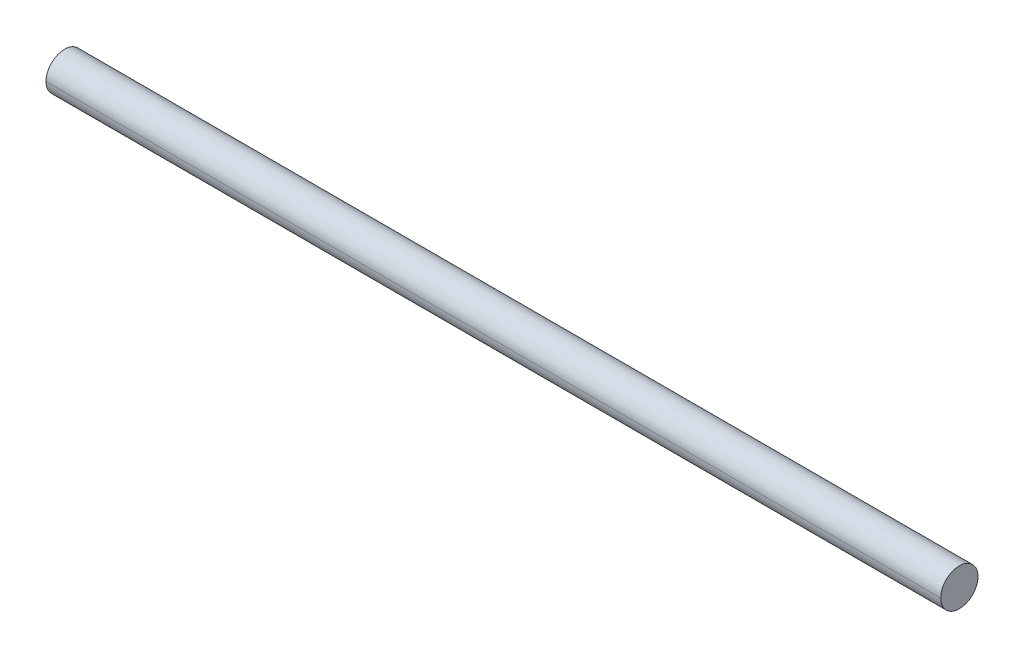
ISO-10303-21;
HEADER;
FILE_DESCRIPTION(('STEP AP214'),'2;1');
FILE_NAME('part.step','',(''),(''),'','','');
FILE_SCHEMA(('AUTOMOTIVE_DESIGN { 1 0 10303 214 1 1 1 1 }'));
ENDSEC;
DATA;
#1=APPLICATION_CONTEXT('core data for automotive mechanical design processes');
#2=APPLICATION_PROTOCOL_DEFINITION('international standard','automotive_design',2000,#1);
#3=PRODUCT_CONTEXT('',#1,'mechanical');
#4=PRODUCT('Part','Part','',(#3));
#5=PRODUCT_RELATED_PRODUCT_CATEGORY('part','',(#4));
#6=PRODUCT_DEFINITION_FORMATION('','',#4);
#7=PRODUCT_DEFINITION_CONTEXT('part definition',#1,'design');
#8=PRODUCT_DEFINITION('design','',#6,#7);
#9=PRODUCT_DEFINITION_SHAPE('','',#8);
#10=(LENGTH_UNIT() NAMED_UNIT(*) SI_UNIT(.MILLI.,.METRE.));
#11=(NAMED_UNIT(*) PLANE_ANGLE_UNIT() SI_UNIT($,.RADIAN.));
#12=(NAMED_UNIT(*) SI_UNIT($,.STERADIAN.) SOLID_ANGLE_UNIT());
#13=UNCERTAINTY_MEASURE_WITH_UNIT(LENGTH_MEASURE(1.E-05),#10,'distance_accuracy_value','');
#14=(GEOMETRIC_REPRESENTATION_CONTEXT(3) GLOBAL_UNCERTAINTY_ASSIGNED_CONTEXT((#13)) GLOBAL_UNIT_ASSIGNED_CONTEXT((#10,
#11,#12)) REPRESENTATION_CONTEXT('',''));
#15=CARTESIAN_POINT('',(0.,0.,0.));
#16=DIRECTION('',(0.,0.,1.));
#17=DIRECTION('',(1.,0.,0.));
#18=AXIS2_PLACEMENT_3D('',#15,#16,#17);
#19=CARTESIAN_POINT('',(600.,0.,0.));
#20=DIRECTION('',(1.,0.,0.));
#21=DIRECTION('',(0.,-1.,0.));
#22=AXIS2_PLACEMENT_3D('',#19,#20,#21);
#23=CYLINDRICAL_SURFACE('',#22,5.);
#24=DIRECTION('',(1.,0.,0.));
#25=VECTOR('',#24,1.);
#26=CARTESIAN_POINT('',(0.,0.,5.));
#27=LINE('',#26,#25);
#28=CARTESIAN_POINT('',(0.,0.,5.));
#29=VERTEX_POINT('',#28);
#30=CARTESIAN_POINT('',(240.,0.,5.));
#31=VERTEX_POINT('',#30);
#32=EDGE_CURVE('E79',#29,#31,#27,.T.);
#33=ORIENTED_EDGE('',*,*,#32,.T.);
#34=CARTESIAN_POINT('',(240.,0.,0.));
#35=DIRECTION('',(1.,0.,0.));
#36=DIRECTION('',(0.,0.,-1.));
#37=AXIS2_PLACEMENT_3D('',#34,#35,#36);
#38=CIRCLE('',#37,5.);
#39=CARTESIAN_POINT('',(240.,0.,-5.));
#40=VERTEX_POINT('',#39);
#41=EDGE_CURVE('E58',#40,#31,#38,.T.);
#42=ORIENTED_EDGE('',*,*,#41,.F.);
#43=DIRECTION('',(1.,0.,0.));
#44=VECTOR('',#43,1.);
#45=CARTESIAN_POINT('',(0.,0.,-5.));
#46=LINE('',#45,#44);
#47=CARTESIAN_POINT('',(0.,0.,-5.));
#48=VERTEX_POINT('',#47);
#49=EDGE_CURVE('E78',#48,#40,#46,.T.);
#50=ORIENTED_EDGE('',*,*,#49,.F.);
#51=CARTESIAN_POINT('',(0.,0.,0.));
#52=DIRECTION('',(1.,0.,0.));
#53=DIRECTION('',(0.,0.,-1.));
#54=AXIS2_PLACEMENT_3D('',#51,#52,#53);
#55=CIRCLE('',#54,5.);
#56=EDGE_CURVE('E52',#48,#29,#55,.T.);
#57=ORIENTED_EDGE('',*,*,#56,.T.);
#58=EDGE_LOOP('',(#33,#42,#50,#57));
#59=FACE_BOUND('',#58,.T.);
#60=ADVANCED_FACE('F42',(#59),#23,.T.);
#61=CARTESIAN_POINT('',(600.,0.,0.));
#62=DIRECTION('',(1.,0.,0.));
#63=DIRECTION('',(0.,1.,0.));
#64=AXIS2_PLACEMENT_3D('',#61,#62,#63);
#65=CYLINDRICAL_SURFACE('',#64,5.);
#66=ORIENTED_EDGE('',*,*,#49,.T.);
#67=EDGE_CURVE('E68',#31,#40,#38,.T.);
#68=ORIENTED_EDGE('',*,*,#67,.F.);
#69=ORIENTED_EDGE('',*,*,#32,.F.);
#70=CARTESIAN_POINT('',(0.,0.,0.));
#71=DIRECTION('',(1.,0.,0.));
#72=DIRECTION('',(0.,0.,-1.));
#73=AXIS2_PLACEMENT_3D('',#70,#71,#72);
#74=CIRCLE('',#73,5.);
#75=EDGE_CURVE('E11',#29,#48,#74,.T.);
#76=ORIENTED_EDGE('',*,*,#75,.T.);
#77=EDGE_LOOP('',(#66,#68,#69,#76));
#78=FACE_BOUND('',#77,.T.);
#79=ADVANCED_FACE('F81',(#78),#65,.T.);
#80=CARTESIAN_POINT('',(0.,0.,0.));
#81=DIRECTION('',(1.,0.,0.));
#82=DIRECTION('',(0.,0.,-1.));
#83=AXIS2_PLACEMENT_3D('',#80,#81,#82);
#84=PLANE('',#83);
#85=ORIENTED_EDGE('',*,*,#75,.F.);
#86=ORIENTED_EDGE('',*,*,#56,.F.);
#87=EDGE_LOOP('',(#85,#86));
#88=FACE_BOUND('',#87,.T.);
#89=ADVANCED_FACE('F44',(#88),#84,.F.);
#90=CARTESIAN_POINT('',(240.,0.,0.));
#91=DIRECTION('',(1.,0.,0.));
#92=DIRECTION('',(0.,0.,-1.));
#93=AXIS2_PLACEMENT_3D('',#90,#91,#92);
#94=PLANE('',#93);
#95=ORIENTED_EDGE('',*,*,#41,.T.);
#96=ORIENTED_EDGE('',*,*,#67,.T.);
#97=EDGE_LOOP('',(#95,#96));
#98=FACE_BOUND('',#97,.T.);
#99=ADVANCED_FACE('F69',(#98),#94,.T.);
#100=CLOSED_SHELL('',(#60,#79,#89,#99));
#101=MANIFOLD_SOLID_BREP('B2',#100);
#102=ADVANCED_BREP_SHAPE_REPRESENTATION('',(#18,#101),#14);
#103=SHAPE_DEFINITION_REPRESENTATION(#9,#102);
ENDSEC;
END-ISO-10303-21;
